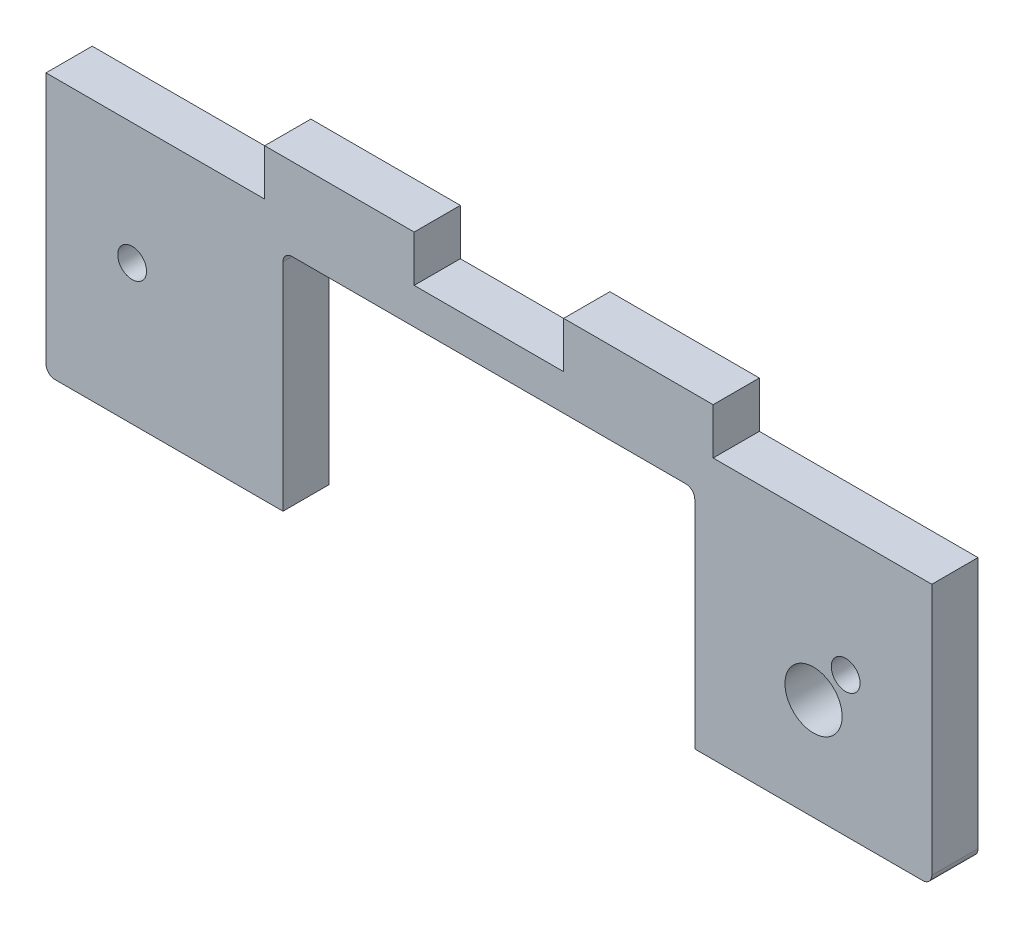
ISO-10303-21;
HEADER;
FILE_DESCRIPTION(('STEP AP214'),'2;1');
FILE_NAME('part.step','',(''),(''),'','','');
FILE_SCHEMA(('AUTOMOTIVE_DESIGN { 1 0 10303 214 1 1 1 1 }'));
ENDSEC;
DATA;
#1=APPLICATION_CONTEXT('core data for automotive mechanical design processes');
#2=APPLICATION_PROTOCOL_DEFINITION('international standard','automotive_design',2000,#1);
#3=PRODUCT_CONTEXT('',#1,'mechanical');
#4=PRODUCT('Part','Part','',(#3));
#5=PRODUCT_RELATED_PRODUCT_CATEGORY('part','',(#4));
#6=PRODUCT_DEFINITION_FORMATION('','',#4);
#7=PRODUCT_DEFINITION_CONTEXT('part definition',#1,'design');
#8=PRODUCT_DEFINITION('design','',#6,#7);
#9=PRODUCT_DEFINITION_SHAPE('','',#8);
#10=(LENGTH_UNIT() NAMED_UNIT(*) SI_UNIT(.MILLI.,.METRE.));
#11=(NAMED_UNIT(*) PLANE_ANGLE_UNIT() SI_UNIT($,.RADIAN.));
#12=(NAMED_UNIT(*) SI_UNIT($,.STERADIAN.) SOLID_ANGLE_UNIT());
#13=UNCERTAINTY_MEASURE_WITH_UNIT(LENGTH_MEASURE(1.E-05),#10,'distance_accuracy_value','');
#14=(GEOMETRIC_REPRESENTATION_CONTEXT(3) GLOBAL_UNCERTAINTY_ASSIGNED_CONTEXT((#13)) GLOBAL_UNIT_ASSIGNED_CONTEXT((#10,
#11,#12)) REPRESENTATION_CONTEXT('',''));
#15=CARTESIAN_POINT('',(0.,0.,0.));
#16=DIRECTION('',(0.,0.,1.));
#17=DIRECTION('',(1.,0.,0.));
#18=AXIS2_PLACEMENT_3D('',#15,#16,#17);
#19=CARTESIAN_POINT('',(-55.4887597438966,1.35674708835044,5.13));
#20=DIRECTION('',(0.,1.,0.));
#21=DIRECTION('',(-1.,0.,0.));
#22=AXIS2_PLACEMENT_3D('',#19,#20,#21);
#23=PLANE('',#22);
#24=DIRECTION('',(1.,0.,0.));
#25=VECTOR('',#24,1.);
#26=CARTESIAN_POINT('',(-55.4887597438966,1.35674708835044,5.13));
#27=LINE('',#26,#25);
#28=CARTESIAN_POINT('',(15.5512402561034,1.35674708835044,5.13));
#29=VERTEX_POINT('',#28);
#30=CARTESIAN_POINT('',(40.8712402561034,1.35674708835044,5.13));
#31=VERTEX_POINT('',#30);
#32=EDGE_CURVE('E449',#29,#31,#27,.T.);
#33=ORIENTED_EDGE('',*,*,#32,.F.);
#34=DIRECTION('',(0.,0.,1.));
#35=VECTOR('',#34,1.);
#36=CARTESIAN_POINT('',(15.5512402561034,1.35674708835044,-0.00104999999999984));
#37=LINE('',#36,#35);
#38=CARTESIAN_POINT('',(15.5512402561034,1.35674708835044,0.));
#39=VERTEX_POINT('',#38);
#40=EDGE_CURVE('E182',#39,#29,#37,.T.);
#41=ORIENTED_EDGE('',*,*,#40,.F.);
#42=DIRECTION('',(1.,0.,0.));
#43=VECTOR('',#42,1.);
#44=CARTESIAN_POINT('',(-55.4887597438966,1.35674708835044,0.));
#45=LINE('',#44,#43);
#46=CARTESIAN_POINT('',(40.8712402561034,1.35674708835044,0.));
#47=VERTEX_POINT('',#46);
#48=EDGE_CURVE('E200',#39,#47,#45,.T.);
#49=ORIENTED_EDGE('',*,*,#48,.T.);
#50=DIRECTION('',(0.,0.,-1.));
#51=VECTOR('',#50,1.);
#52=CARTESIAN_POINT('',(40.8712402561034,1.35674708835044,5.13));
#53=LINE('',#52,#51);
#54=EDGE_CURVE('E224',#31,#47,#53,.T.);
#55=ORIENTED_EDGE('',*,*,#54,.F.);
#56=EDGE_LOOP('',(#33,#41,#49,#55));
#57=FACE_BOUND('',#56,.T.);
#58=ADVANCED_FACE('F32',(#57),#23,.F.);
#59=CARTESIAN_POINT('',(-55.4887597438966,2.35674708835044,5.13));
#60=DIRECTION('',(0.,0.,-1.));
#61=DIRECTION('',(-1.,0.,0.));
#62=AXIS2_PLACEMENT_3D('',#59,#60,#61);
#63=PLANE('',#62);
#64=CARTESIAN_POINT('',(28.7382402561034,12.6521396028309,5.13));
#65=DIRECTION('',(0.,0.,1.));
#66=DIRECTION('',(1.,0.,0.));
#67=AXIS2_PLACEMENT_3D('',#64,#65,#66);
#68=CIRCLE('',#67,3.175);
#69=CARTESIAN_POINT('',(31.9132402561034,12.6521396028309,5.13));
#70=VERTEX_POINT('',#69);
#71=EDGE_CURVE('E368',#70,#70,#68,.T.);
#72=ORIENTED_EDGE('',*,*,#71,.F.);
#73=EDGE_LOOP('',(#72));
#74=FACE_BOUND('',#73,.T.);
#75=CARTESIAN_POINT('',(32.3062402561034,16.8567470883504,5.13));
#76=DIRECTION('',(0.,0.,1.));
#77=DIRECTION('',(1.,0.,0.));
#78=AXIS2_PLACEMENT_3D('',#75,#76,#77);
#79=CIRCLE('',#78,1.59999999999999);
#80=CARTESIAN_POINT('',(33.9062402561034,16.8567470883504,5.13));
#81=VERTEX_POINT('',#80);
#82=EDGE_CURVE('E333',#81,#81,#79,.T.);
#83=ORIENTED_EDGE('',*,*,#82,.F.);
#84=EDGE_LOOP('',(#83));
#85=FACE_BOUND('',#84,.T.);
#86=CARTESIAN_POINT('',(14.5512402561034,25.3567470883504,5.13));
#87=DIRECTION('',(0.,0.,1.));
#88=DIRECTION('',(1.,0.,0.));
#89=AXIS2_PLACEMENT_3D('',#86,#87,#88);
#90=CIRCLE('',#89,1.);
#91=CARTESIAN_POINT('',(15.5512402561034,25.3567470883504,5.13));
#92=VERTEX_POINT('',#91);
#93=CARTESIAN_POINT('',(14.5512402561034,26.3567470883504,5.13));
#94=VERTEX_POINT('',#93);
#95=EDGE_CURVE('E359',#92,#94,#90,.T.);
#96=ORIENTED_EDGE('',*,*,#95,.F.);
#97=DIRECTION('',(0.,1.,0.));
#98=VECTOR('',#97,1.);
#99=CARTESIAN_POINT('',(15.5512402561034,25.3567470883504,5.13));
#100=LINE('',#99,#98);
#101=EDGE_CURVE('E361',#29,#92,#100,.T.);
#102=ORIENTED_EDGE('',*,*,#101,.F.);
#103=ORIENTED_EDGE('',*,*,#32,.T.);
#104=CARTESIAN_POINT('',(40.8712402561034,2.35674708835044,5.13));
#105=DIRECTION('',(0.,0.,1.));
#106=DIRECTION('',(1.,0.,0.));
#107=AXIS2_PLACEMENT_3D('',#104,#105,#106);
#108=CIRCLE('',#107,1.);
#109=CARTESIAN_POINT('',(41.8712402561034,2.35674708835045,5.13));
#110=VERTEX_POINT('',#109);
#111=EDGE_CURVE('E452',#31,#110,#108,.T.);
#112=ORIENTED_EDGE('',*,*,#111,.T.);
#113=DIRECTION('',(0.,1.,0.));
#114=VECTOR('',#113,1.);
#115=CARTESIAN_POINT('',(41.8712402561034,30.3567470883504,5.13));
#116=LINE('',#115,#114);
#117=CARTESIAN_POINT('',(41.8712402561034,30.3567470883504,5.13));
#118=VERTEX_POINT('',#117);
#119=EDGE_CURVE('E251',#110,#118,#116,.T.);
#120=ORIENTED_EDGE('',*,*,#119,.T.);
#121=DIRECTION('',(-1.,0.,0.));
#122=VECTOR('',#121,1.);
#123=CARTESIAN_POINT('',(-56.4887597438966,30.3567470883504,5.13));
#124=LINE('',#123,#122);
#125=CARTESIAN_POINT('',(17.5912402561034,30.3567470883504,5.13));
#126=VERTEX_POINT('',#125);
#127=EDGE_CURVE('E236',#118,#126,#124,.T.);
#128=ORIENTED_EDGE('',*,*,#127,.T.);
#129=DIRECTION('',(0.,-1.,0.));
#130=VECTOR('',#129,1.);
#131=CARTESIAN_POINT('',(17.5912402561034,35.4867470883504,5.13));
#132=LINE('',#131,#130);
#133=CARTESIAN_POINT('',(17.5912402561034,35.4867470883504,5.13));
#134=VERTEX_POINT('',#133);
#135=EDGE_CURVE('E259',#134,#126,#132,.T.);
#136=ORIENTED_EDGE('',*,*,#135,.F.);
#137=DIRECTION('',(1.,0.,0.));
#138=VECTOR('',#137,1.);
#139=CARTESIAN_POINT('',(0.991240256103407,35.4867470883504,5.12999999999977));
#140=LINE('',#139,#138);
#141=CARTESIAN_POINT('',(0.991240256103407,35.4867470883504,5.12999999999977));
#142=VERTEX_POINT('',#141);
#143=EDGE_CURVE('E300',#142,#134,#140,.T.);
#144=ORIENTED_EDGE('',*,*,#143,.F.);
#145=DIRECTION('',(0.,-1.,0.));
#146=VECTOR('',#145,1.);
#147=CARTESIAN_POINT('',(0.991240256103407,35.4867470883504,5.12999999999977));
#148=LINE('',#147,#146);
#149=CARTESIAN_POINT('',(0.991240256103407,30.3567470883504,5.13));
#150=VERTEX_POINT('',#149);
#151=EDGE_CURVE('E256',#142,#150,#148,.T.);
#152=ORIENTED_EDGE('',*,*,#151,.T.);
#153=CARTESIAN_POINT('',(-15.6087597438966,30.3567470883504,5.13));
#154=VERTEX_POINT('',#153);
#155=EDGE_CURVE('E242',#150,#154,#124,.T.);
#156=ORIENTED_EDGE('',*,*,#155,.T.);
#157=DIRECTION('',(0.,-1.,0.));
#158=VECTOR('',#157,1.);
#159=CARTESIAN_POINT('',(-15.6087597438966,35.4867470883504,5.13000000000023));
#160=LINE('',#159,#158);
#161=CARTESIAN_POINT('',(-15.6087597438966,35.4867470883504,5.13000000000023));
#162=VERTEX_POINT('',#161);
#163=EDGE_CURVE('E306',#162,#154,#160,.T.);
#164=ORIENTED_EDGE('',*,*,#163,.F.);
#165=DIRECTION('',(1.,0.,0.));
#166=VECTOR('',#165,1.);
#167=CARTESIAN_POINT('',(-32.2087597438966,35.4867470883504,5.13));
#168=LINE('',#167,#166);
#169=CARTESIAN_POINT('',(-32.2087597438966,35.4867470883504,5.13));
#170=VERTEX_POINT('',#169);
#171=EDGE_CURVE('E327',#170,#162,#168,.T.);
#172=ORIENTED_EDGE('',*,*,#171,.F.);
#173=DIRECTION('',(0.,-1.,0.));
#174=VECTOR('',#173,1.);
#175=CARTESIAN_POINT('',(-32.2087597438966,35.4867470883504,5.13));
#176=LINE('',#175,#174);
#177=CARTESIAN_POINT('',(-32.2087597438966,30.3567470883504,5.13));
#178=VERTEX_POINT('',#177);
#179=EDGE_CURVE('E274',#170,#178,#176,.T.);
#180=ORIENTED_EDGE('',*,*,#179,.T.);
#181=CARTESIAN_POINT('',(-56.4887597438966,30.3567470883504,5.13));
#182=VERTEX_POINT('',#181);
#183=EDGE_CURVE('E36',#178,#182,#124,.T.);
#184=ORIENTED_EDGE('',*,*,#183,.T.);
#185=DIRECTION('',(0.,-1.,0.));
#186=VECTOR('',#185,1.);
#187=CARTESIAN_POINT('',(-56.4887597438966,30.3567470883504,5.13));
#188=LINE('',#187,#186);
#189=CARTESIAN_POINT('',(-56.4887597438966,2.35674708835045,5.13));
#190=VERTEX_POINT('',#189);
#191=EDGE_CURVE('E221',#182,#190,#188,.T.);
#192=ORIENTED_EDGE('',*,*,#191,.T.);
#193=CARTESIAN_POINT('',(-55.4887597438966,2.35674708835044,5.13));
#194=DIRECTION('',(0.,0.,1.));
#195=DIRECTION('',(-1.,0.,0.));
#196=AXIS2_PLACEMENT_3D('',#193,#194,#195);
#197=CIRCLE('',#196,1.);
#198=CARTESIAN_POINT('',(-55.4887597438966,1.35674708835044,5.13));
#199=VERTEX_POINT('',#198);
#200=EDGE_CURVE('E448',#190,#199,#197,.T.);
#201=ORIENTED_EDGE('',*,*,#200,.T.);
#202=CARTESIAN_POINT('',(-30.1687597438966,1.35674708835044,5.13));
#203=VERTEX_POINT('',#202);
#204=EDGE_CURVE('E450',#199,#203,#27,.T.);
#205=ORIENTED_EDGE('',*,*,#204,.T.);
#206=DIRECTION('',(0.,-1.,0.));
#207=VECTOR('',#206,1.);
#208=CARTESIAN_POINT('',(-30.1687597438966,25.3567470883504,5.13));
#209=LINE('',#208,#207);
#210=CARTESIAN_POINT('',(-30.1687597438966,25.3567470883504,5.13));
#211=VERTEX_POINT('',#210);
#212=EDGE_CURVE('E177',#211,#203,#209,.T.);
#213=ORIENTED_EDGE('',*,*,#212,.F.);
#214=CARTESIAN_POINT('',(-29.1687597438966,25.3567470883504,5.13));
#215=DIRECTION('',(0.,0.,1.));
#216=DIRECTION('',(-1.,0.,0.));
#217=AXIS2_PLACEMENT_3D('',#214,#215,#216);
#218=CIRCLE('',#217,1.);
#219=CARTESIAN_POINT('',(-29.1687597438966,26.3567470883504,5.13));
#220=VERTEX_POINT('',#219);
#221=EDGE_CURVE('E353',#220,#211,#218,.T.);
#222=ORIENTED_EDGE('',*,*,#221,.F.);
#223=DIRECTION('',(-1.,0.,0.));
#224=VECTOR('',#223,1.);
#225=CARTESIAN_POINT('',(-29.1687597438966,26.3567470883504,5.13));
#226=LINE('',#225,#224);
#227=EDGE_CURVE('E356',#94,#220,#226,.T.);
#228=ORIENTED_EDGE('',*,*,#227,.F.);
#229=EDGE_LOOP('',(#96,#102,#103,#112,#120,#128,#136,#144,#152,#156,#164,#172,#180,#184,#192,
#201,#205,#213,#222,#228));
#230=FACE_BOUND('',#229,.T.);
#231=CARTESIAN_POINT('',(-46.9237597438966,16.8567470883504,5.13));
#232=DIRECTION('',(0.,0.,1.));
#233=DIRECTION('',(1.,0.,0.));
#234=AXIS2_PLACEMENT_3D('',#231,#232,#233);
#235=CIRCLE('',#234,1.59999999999998);
#236=CARTESIAN_POINT('',(-45.3237597438966,16.8567470883504,5.13));
#237=VERTEX_POINT('',#236);
#238=EDGE_CURVE('E339',#237,#237,#235,.T.);
#239=ORIENTED_EDGE('',*,*,#238,.F.);
#240=EDGE_LOOP('',(#239));
#241=FACE_BOUND('',#240,.T.);
#242=ADVANCED_FACE('F377',(#74,#85,#230,#241),#63,.F.);
#243=CARTESIAN_POINT('',(-56.4887597438966,30.3567470883504,5.13));
#244=DIRECTION('',(0.,-1.,0.));
#245=DIRECTION('',(0.,0.,-1.));
#246=AXIS2_PLACEMENT_3D('',#243,#244,#245);
#247=PLANE('',#246);
#248=DIRECTION('',(0.,0.,1.));
#249=VECTOR('',#248,1.);
#250=CARTESIAN_POINT('',(-32.2087597438966,30.3567470883504,5.13));
#251=LINE('',#250,#249);
#252=CARTESIAN_POINT('',(-32.2087597438966,30.3567470883504,2.31834495177663E-13));
#253=VERTEX_POINT('',#252);
#254=EDGE_CURVE('E320',#253,#178,#251,.T.);
#255=ORIENTED_EDGE('',*,*,#254,.F.);
#256=DIRECTION('',(-1.,0.,0.));
#257=VECTOR('',#256,1.);
#258=CARTESIAN_POINT('',(-56.4887597438966,30.3567470883504,0.));
#259=LINE('',#258,#257);
#260=CARTESIAN_POINT('',(-56.4887597438966,30.3567470883504,0.));
#261=VERTEX_POINT('',#260);
#262=EDGE_CURVE('E209',#253,#261,#259,.T.);
#263=ORIENTED_EDGE('',*,*,#262,.T.);
#264=DIRECTION('',(0.,0.,-1.));
#265=VECTOR('',#264,1.);
#266=CARTESIAN_POINT('',(-56.4887597438966,30.3567470883504,5.13));
#267=LINE('',#266,#265);
#268=EDGE_CURVE('E212',#182,#261,#267,.T.);
#269=ORIENTED_EDGE('',*,*,#268,.F.);
#270=ORIENTED_EDGE('',*,*,#183,.F.);
#271=EDGE_LOOP('',(#255,#263,#269,#270));
#272=FACE_BOUND('',#271,.T.);
#273=ADVANCED_FACE('F380',(#272),#247,.F.);
#274=DIRECTION('',(0.,0.,-1.));
#275=VECTOR('',#274,1.);
#276=CARTESIAN_POINT('',(-15.6087597438966,30.3567470883504,5.13000000000023));
#277=LINE('',#276,#275);
#278=CARTESIAN_POINT('',(-15.6087597438966,30.3567470883504,0.));
#279=VERTEX_POINT('',#278);
#280=EDGE_CURVE('E316',#154,#279,#277,.T.);
#281=ORIENTED_EDGE('',*,*,#280,.F.);
#282=ORIENTED_EDGE('',*,*,#155,.F.);
#283=DIRECTION('',(0.,0.,1.));
#284=VECTOR('',#283,1.);
#285=CARTESIAN_POINT('',(0.991240256103407,30.3567470883504,5.12999999999977));
#286=LINE('',#285,#284);
#287=CARTESIAN_POINT('',(0.991240256103407,30.3567470883504,0.));
#288=VERTEX_POINT('',#287);
#289=EDGE_CURVE('E270',#288,#150,#286,.T.);
#290=ORIENTED_EDGE('',*,*,#289,.F.);
#291=EDGE_CURVE('E217',#288,#279,#259,.T.);
#292=ORIENTED_EDGE('',*,*,#291,.T.);
#293=EDGE_LOOP('',(#281,#282,#290,#292));
#294=FACE_BOUND('',#293,.T.);
#295=ADVANCED_FACE('F446',(#294),#247,.F.);
#296=DIRECTION('',(0.,0.,-1.));
#297=VECTOR('',#296,1.);
#298=CARTESIAN_POINT('',(17.5912402561034,30.3567470883504,5.13));
#299=LINE('',#298,#297);
#300=CARTESIAN_POINT('',(17.5912402561034,30.3567470883504,0.));
#301=VERTEX_POINT('',#300);
#302=EDGE_CURVE('E273',#126,#301,#299,.T.);
#303=ORIENTED_EDGE('',*,*,#302,.F.);
#304=ORIENTED_EDGE('',*,*,#127,.F.);
#305=DIRECTION('',(0.,0.,-1.));
#306=VECTOR('',#305,1.);
#307=CARTESIAN_POINT('',(41.8712402561034,30.3567470883504,5.13));
#308=LINE('',#307,#306);
#309=CARTESIAN_POINT('',(41.8712402561034,30.3567470883504,0.));
#310=VERTEX_POINT('',#309);
#311=EDGE_CURVE('E229',#118,#310,#308,.T.);
#312=ORIENTED_EDGE('',*,*,#311,.T.);
#313=EDGE_CURVE('E220',#310,#301,#259,.T.);
#314=ORIENTED_EDGE('',*,*,#313,.T.);
#315=EDGE_LOOP('',(#303,#304,#312,#314));
#316=FACE_BOUND('',#315,.T.);
#317=ADVANCED_FACE('F433',(#316),#247,.F.);
#318=CARTESIAN_POINT('',(-56.4887597438966,30.3567470883504,5.13));
#319=DIRECTION('',(1.,0.,0.));
#320=DIRECTION('',(0.,0.,-1.));
#321=AXIS2_PLACEMENT_3D('',#318,#319,#320);
#322=PLANE('',#321);
#323=DIRECTION('',(0.,-1.,0.));
#324=VECTOR('',#323,1.);
#325=CARTESIAN_POINT('',(-56.4887597438966,30.3567470883504,0.));
#326=LINE('',#325,#324);
#327=CARTESIAN_POINT('',(-56.4887597438966,2.35674708835045,0.));
#328=VERTEX_POINT('',#327);
#329=EDGE_CURVE('E253',#261,#328,#326,.T.);
#330=ORIENTED_EDGE('',*,*,#329,.T.);
#331=DIRECTION('',(0.,0.,-1.));
#332=VECTOR('',#331,1.);
#333=CARTESIAN_POINT('',(-56.4887597438966,2.35674708835045,5.13));
#334=LINE('',#333,#332);
#335=EDGE_CURVE('E11',#190,#328,#334,.T.);
#336=ORIENTED_EDGE('',*,*,#335,.F.);
#337=ORIENTED_EDGE('',*,*,#191,.F.);
#338=ORIENTED_EDGE('',*,*,#268,.T.);
#339=EDGE_LOOP('',(#330,#336,#337,#338));
#340=FACE_BOUND('',#339,.T.);
#341=ADVANCED_FACE('F34',(#340),#322,.F.);
#342=CARTESIAN_POINT('',(-55.4887597438966,2.35674708835044,5.13));
#343=DIRECTION('',(0.,0.,-1.));
#344=DIRECTION('',(-1.,0.,0.));
#345=AXIS2_PLACEMENT_3D('',#342,#343,#344);
#346=CYLINDRICAL_SURFACE('',#345,1.);
#347=CARTESIAN_POINT('',(-55.4887597438966,2.35674708835044,0.));
#348=DIRECTION('',(0.,0.,1.));
#349=DIRECTION('',(-1.,0.,0.));
#350=AXIS2_PLACEMENT_3D('',#347,#348,#349);
#351=CIRCLE('',#350,1.);
#352=CARTESIAN_POINT('',(-55.4887597438966,1.35674708835044,0.));
#353=VERTEX_POINT('',#352);
#354=EDGE_CURVE('E204',#328,#353,#351,.T.);
#355=ORIENTED_EDGE('',*,*,#354,.T.);
#356=DIRECTION('',(0.,0.,-1.));
#357=VECTOR('',#356,1.);
#358=CARTESIAN_POINT('',(-55.4887597438966,1.35674708835044,5.13));
#359=LINE('',#358,#357);
#360=EDGE_CURVE('E42',#199,#353,#359,.T.);
#361=ORIENTED_EDGE('',*,*,#360,.F.);
#362=ORIENTED_EDGE('',*,*,#200,.F.);
#363=ORIENTED_EDGE('',*,*,#335,.T.);
#364=EDGE_LOOP('',(#355,#361,#362,#363));
#365=FACE_BOUND('',#364,.T.);
#366=ADVANCED_FACE('F423',(#365),#346,.T.);
#367=CARTESIAN_POINT('',(-30.1687597438966,1.35674708835044,0.));
#368=VERTEX_POINT('',#367);
#369=EDGE_CURVE('E191',#353,#368,#45,.T.);
#370=ORIENTED_EDGE('',*,*,#369,.T.);
#371=DIRECTION('',(0.,0.,1.));
#372=VECTOR('',#371,1.);
#373=CARTESIAN_POINT('',(-30.1687597438966,1.35674708835044,-0.00104999999999984));
#374=LINE('',#373,#372);
#375=EDGE_CURVE('E171',#368,#203,#374,.T.);
#376=ORIENTED_EDGE('',*,*,#375,.T.);
#377=ORIENTED_EDGE('',*,*,#204,.F.);
#378=ORIENTED_EDGE('',*,*,#360,.T.);
#379=EDGE_LOOP('',(#370,#376,#377,#378));
#380=FACE_BOUND('',#379,.T.);
#381=ADVANCED_FACE('F197',(#380),#23,.F.);
#382=CARTESIAN_POINT('',(40.8712402561034,2.35674708835044,5.13));
#383=DIRECTION('',(0.,0.,-1.));
#384=DIRECTION('',(-1.,0.,0.));
#385=AXIS2_PLACEMENT_3D('',#382,#383,#384);
#386=CYLINDRICAL_SURFACE('',#385,1.);
#387=CARTESIAN_POINT('',(40.8712402561034,2.35674708835044,0.));
#388=DIRECTION('',(0.,0.,1.));
#389=DIRECTION('',(1.,0.,0.));
#390=AXIS2_PLACEMENT_3D('',#387,#388,#389);
#391=CIRCLE('',#390,1.);
#392=CARTESIAN_POINT('',(41.8712402561034,2.35674708835045,0.));
#393=VERTEX_POINT('',#392);
#394=EDGE_CURVE('E199',#47,#393,#391,.T.);
#395=ORIENTED_EDGE('',*,*,#394,.T.);
#396=DIRECTION('',(0.,0.,-1.));
#397=VECTOR('',#396,1.);
#398=CARTESIAN_POINT('',(41.8712402561034,2.35674708835045,5.13));
#399=LINE('',#398,#397);
#400=EDGE_CURVE('E227',#110,#393,#399,.T.);
#401=ORIENTED_EDGE('',*,*,#400,.F.);
#402=ORIENTED_EDGE('',*,*,#111,.F.);
#403=ORIENTED_EDGE('',*,*,#54,.T.);
#404=EDGE_LOOP('',(#395,#401,#402,#403));
#405=FACE_BOUND('',#404,.T.);
#406=ADVANCED_FACE('F422',(#405),#386,.T.);
#407=CARTESIAN_POINT('',(41.8712402561034,30.3567470883504,5.13));
#408=DIRECTION('',(-1.,0.,0.));
#409=DIRECTION('',(0.,-1.,0.));
#410=AXIS2_PLACEMENT_3D('',#407,#408,#409);
#411=PLANE('',#410);
#412=DIRECTION('',(0.,1.,0.));
#413=VECTOR('',#412,1.);
#414=CARTESIAN_POINT('',(41.8712402561034,30.3567470883504,0.));
#415=LINE('',#414,#413);
#416=EDGE_CURVE('E202',#393,#310,#415,.T.);
#417=ORIENTED_EDGE('',*,*,#416,.T.);
#418=ORIENTED_EDGE('',*,*,#311,.F.);
#419=ORIENTED_EDGE('',*,*,#119,.F.);
#420=ORIENTED_EDGE('',*,*,#400,.T.);
#421=EDGE_LOOP('',(#417,#418,#419,#420));
#422=FACE_BOUND('',#421,.T.);
#423=ADVANCED_FACE('F399',(#422),#411,.F.);
#424=CARTESIAN_POINT('',(-55.4887597438966,2.35674708835044,0.));
#425=DIRECTION('',(0.,0.,-1.));
#426=DIRECTION('',(-1.,0.,0.));
#427=AXIS2_PLACEMENT_3D('',#424,#425,#426);
#428=PLANE('',#427);
#429=CARTESIAN_POINT('',(28.7382402561034,12.6521396028309,0.));
#430=DIRECTION('',(0.,0.,-1.));
#431=DIRECTION('',(-1.,0.,0.));
#432=AXIS2_PLACEMENT_3D('',#429,#430,#431);
#433=CIRCLE('',#432,3.175);
#434=CARTESIAN_POINT('',(25.5632402561034,12.6521396028309,0.));
#435=VERTEX_POINT('',#434);
#436=EDGE_CURVE('E369',#435,#435,#433,.F.);
#437=ORIENTED_EDGE('',*,*,#436,.T.);
#438=EDGE_LOOP('',(#437));
#439=FACE_BOUND('',#438,.T.);
#440=DIRECTION('',(0.,1.,0.));
#441=VECTOR('',#440,1.);
#442=CARTESIAN_POINT('',(15.5512402561034,25.3567470883504,0.));
#443=LINE('',#442,#441);
#444=CARTESIAN_POINT('',(15.5512402561034,25.3567470883504,0.));
#445=VERTEX_POINT('',#444);
#446=EDGE_CURVE('E194',#39,#445,#443,.T.);
#447=ORIENTED_EDGE('',*,*,#446,.T.);
#448=CARTESIAN_POINT('',(14.5512402561034,25.3567470883504,0.));
#449=DIRECTION('',(0.,0.,-1.));
#450=DIRECTION('',(-1.,0.,0.));
#451=AXIS2_PLACEMENT_3D('',#448,#449,#450);
#452=CIRCLE('',#451,1.);
#453=CARTESIAN_POINT('',(14.5512402561034,26.3567470883504,0.));
#454=VERTEX_POINT('',#453);
#455=EDGE_CURVE('E342',#445,#454,#452,.F.);
#456=ORIENTED_EDGE('',*,*,#455,.T.);
#457=DIRECTION('',(-1.,0.,0.));
#458=VECTOR('',#457,1.);
#459=CARTESIAN_POINT('',(-29.1687597438966,26.3567470883504,0.));
#460=LINE('',#459,#458);
#461=CARTESIAN_POINT('',(-29.1687597438966,26.3567470883504,0.));
#462=VERTEX_POINT('',#461);
#463=EDGE_CURVE('E366',#454,#462,#460,.T.);
#464=ORIENTED_EDGE('',*,*,#463,.T.);
#465=CARTESIAN_POINT('',(-29.1687597438966,25.3567470883504,0.));
#466=DIRECTION('',(0.,0.,-1.));
#467=DIRECTION('',(-1.,0.,0.));
#468=AXIS2_PLACEMENT_3D('',#465,#466,#467);
#469=CIRCLE('',#468,1.);
#470=CARTESIAN_POINT('',(-30.1687597438966,25.3567470883504,0.));
#471=VERTEX_POINT('',#470);
#472=EDGE_CURVE('E193',#462,#471,#469,.F.);
#473=ORIENTED_EDGE('',*,*,#472,.T.);
#474=DIRECTION('',(0.,-1.,0.));
#475=VECTOR('',#474,1.);
#476=CARTESIAN_POINT('',(-30.1687597438966,25.3567470883504,0.));
#477=LINE('',#476,#475);
#478=EDGE_CURVE('E174',#471,#368,#477,.T.);
#479=ORIENTED_EDGE('',*,*,#478,.T.);
#480=ORIENTED_EDGE('',*,*,#369,.F.);
#481=ORIENTED_EDGE('',*,*,#354,.F.);
#482=ORIENTED_EDGE('',*,*,#329,.F.);
#483=ORIENTED_EDGE('',*,*,#262,.F.);
#484=DIRECTION('',(0.,-1.,0.));
#485=VECTOR('',#484,1.);
#486=CARTESIAN_POINT('',(-32.2087597438966,35.4867470883504,2.31834495177663E-13));
#487=LINE('',#486,#485);
#488=CARTESIAN_POINT('',(-32.2087597438966,35.4867470883504,2.31834495177663E-13));
#489=VERTEX_POINT('',#488);
#490=EDGE_CURVE('E312',#489,#253,#487,.T.);
#491=ORIENTED_EDGE('',*,*,#490,.F.);
#492=DIRECTION('',(-1.,0.,0.));
#493=VECTOR('',#492,1.);
#494=CARTESIAN_POINT('',(-32.2087597438966,35.4867470883504,2.31834495177663E-13));
#495=LINE('',#494,#493);
#496=CARTESIAN_POINT('',(-15.6087597438966,35.4867470883504,2.31834495177663E-13));
#497=VERTEX_POINT('',#496);
#498=EDGE_CURVE('E315',#497,#489,#495,.T.);
#499=ORIENTED_EDGE('',*,*,#498,.F.);
#500=DIRECTION('',(0.,-1.,0.));
#501=VECTOR('',#500,1.);
#502=CARTESIAN_POINT('',(-15.6087597438966,35.4867470883504,2.31834495177663E-13));
#503=LINE('',#502,#501);
#504=EDGE_CURVE('E309',#497,#279,#503,.T.);
#505=ORIENTED_EDGE('',*,*,#504,.T.);
#506=ORIENTED_EDGE('',*,*,#291,.F.);
#507=DIRECTION('',(0.,-1.,0.));
#508=VECTOR('',#507,1.);
#509=CARTESIAN_POINT('',(0.991240256103407,35.4867470883504,0.));
#510=LINE('',#509,#508);
#511=CARTESIAN_POINT('',(0.991240256103407,35.4867470883504,0.));
#512=VERTEX_POINT('',#511);
#513=EDGE_CURVE('E275',#512,#288,#510,.T.);
#514=ORIENTED_EDGE('',*,*,#513,.F.);
#515=DIRECTION('',(-1.,0.,0.));
#516=VECTOR('',#515,1.);
#517=CARTESIAN_POINT('',(0.991240256103407,35.4867470883504,0.));
#518=LINE('',#517,#516);
#519=CARTESIAN_POINT('',(17.5912402561034,35.4867470883504,0.));
#520=VERTEX_POINT('',#519);
#521=EDGE_CURVE('E280',#520,#512,#518,.T.);
#522=ORIENTED_EDGE('',*,*,#521,.F.);
#523=DIRECTION('',(0.,-1.,0.));
#524=VECTOR('',#523,1.);
#525=CARTESIAN_POINT('',(17.5912402561034,35.4867470883504,0.));
#526=LINE('',#525,#524);
#527=EDGE_CURVE('E263',#520,#301,#526,.T.);
#528=ORIENTED_EDGE('',*,*,#527,.T.);
#529=ORIENTED_EDGE('',*,*,#313,.F.);
#530=ORIENTED_EDGE('',*,*,#416,.F.);
#531=ORIENTED_EDGE('',*,*,#394,.F.);
#532=ORIENTED_EDGE('',*,*,#48,.F.);
#533=EDGE_LOOP('',(#447,#456,#464,#473,#479,#480,#481,#482,#483,#491,#499,#505,#506,#514,#522,
#528,#529,#530,#531,#532));
#534=FACE_BOUND('',#533,.T.);
#535=CARTESIAN_POINT('',(-46.9237597438966,16.8567470883504,0.));
#536=DIRECTION('',(0.,0.,-1.));
#537=DIRECTION('',(-1.,0.,0.));
#538=AXIS2_PLACEMENT_3D('',#535,#536,#537);
#539=CIRCLE('',#538,1.59999999999999);
#540=CARTESIAN_POINT('',(-48.5237597438966,16.8567470883504,0.));
#541=VERTEX_POINT('',#540);
#542=EDGE_CURVE('E336',#541,#541,#539,.T.);
#543=ORIENTED_EDGE('',*,*,#542,.F.);
#544=EDGE_LOOP('',(#543));
#545=FACE_BOUND('',#544,.T.);
#546=CARTESIAN_POINT('',(32.3062402561034,16.8567470883504,0.));
#547=DIRECTION('',(0.,0.,-1.));
#548=DIRECTION('',(-1.,0.,0.));
#549=AXIS2_PLACEMENT_3D('',#546,#547,#548);
#550=CIRCLE('',#549,1.59999999999999);
#551=CARTESIAN_POINT('',(30.7062402561034,16.8567470883504,0.));
#552=VERTEX_POINT('',#551);
#553=EDGE_CURVE('E323',#552,#552,#550,.T.);
#554=ORIENTED_EDGE('',*,*,#553,.F.);
#555=EDGE_LOOP('',(#554));
#556=FACE_BOUND('',#555,.T.);
#557=ADVANCED_FACE('F189',(#439,#534,#545,#556),#428,.T.);
#558=CARTESIAN_POINT('',(0.991240256103407,35.4867470883504,5.12999999999977));
#559=DIRECTION('',(1.,0.,0.));
#560=DIRECTION('',(0.,0.,-1.));
#561=AXIS2_PLACEMENT_3D('',#558,#559,#560);
#562=PLANE('',#561);
#563=ORIENTED_EDGE('',*,*,#289,.T.);
#564=ORIENTED_EDGE('',*,*,#151,.F.);
#565=DIRECTION('',(0.,0.,1.));
#566=VECTOR('',#565,1.);
#567=CARTESIAN_POINT('',(0.991240256103407,35.4867470883504,5.12999999999977));
#568=LINE('',#567,#566);
#569=EDGE_CURVE('E287',#512,#142,#568,.T.);
#570=ORIENTED_EDGE('',*,*,#569,.F.);
#571=ORIENTED_EDGE('',*,*,#513,.T.);
#572=EDGE_LOOP('',(#563,#564,#570,#571));
#573=FACE_BOUND('',#572,.T.);
#574=ADVANCED_FACE('F398',(#573),#562,.F.);
#575=CARTESIAN_POINT('',(17.5912402561034,35.4867470883504,5.13));
#576=DIRECTION('',(-1.,0.,0.));
#577=DIRECTION('',(0.,0.,1.));
#578=AXIS2_PLACEMENT_3D('',#575,#576,#577);
#579=PLANE('',#578);
#580=ORIENTED_EDGE('',*,*,#302,.T.);
#581=ORIENTED_EDGE('',*,*,#527,.F.);
#582=DIRECTION('',(0.,0.,-1.));
#583=VECTOR('',#582,1.);
#584=CARTESIAN_POINT('',(17.5912402561034,35.4867470883504,5.13));
#585=LINE('',#584,#583);
#586=EDGE_CURVE('E297',#134,#520,#585,.T.);
#587=ORIENTED_EDGE('',*,*,#586,.F.);
#588=ORIENTED_EDGE('',*,*,#135,.T.);
#589=EDGE_LOOP('',(#580,#581,#587,#588));
#590=FACE_BOUND('',#589,.T.);
#591=ADVANCED_FACE('F459',(#590),#579,.F.);
#592=CARTESIAN_POINT('',(0.991240256103407,35.4867470883504,0.));
#593=DIRECTION('',(0.,-1.,0.));
#594=DIRECTION('',(0.,0.,-1.));
#595=AXIS2_PLACEMENT_3D('',#592,#593,#594);
#596=PLANE('',#595);
#597=ORIENTED_EDGE('',*,*,#569,.T.);
#598=ORIENTED_EDGE('',*,*,#143,.T.);
#599=ORIENTED_EDGE('',*,*,#586,.T.);
#600=ORIENTED_EDGE('',*,*,#521,.T.);
#601=EDGE_LOOP('',(#597,#598,#599,#600));
#602=FACE_BOUND('',#601,.T.);
#603=ADVANCED_FACE('F460',(#602),#596,.F.);
#604=CARTESIAN_POINT('',(-32.2087597438966,35.4867470883504,5.13));
#605=DIRECTION('',(1.,0.,0.));
#606=DIRECTION('',(0.,0.,-1.));
#607=AXIS2_PLACEMENT_3D('',#604,#605,#606);
#608=PLANE('',#607);
#609=ORIENTED_EDGE('',*,*,#254,.T.);
#610=ORIENTED_EDGE('',*,*,#179,.F.);
#611=DIRECTION('',(0.,0.,1.));
#612=VECTOR('',#611,1.);
#613=CARTESIAN_POINT('',(-32.2087597438966,35.4867470883504,5.13));
#614=LINE('',#613,#612);
#615=EDGE_CURVE('E319',#489,#170,#614,.T.);
#616=ORIENTED_EDGE('',*,*,#615,.F.);
#617=ORIENTED_EDGE('',*,*,#490,.T.);
#618=EDGE_LOOP('',(#609,#610,#616,#617));
#619=FACE_BOUND('',#618,.T.);
#620=ADVANCED_FACE('F439',(#619),#608,.F.);
#621=CARTESIAN_POINT('',(-15.6087597438966,35.4867470883504,5.13000000000023));
#622=DIRECTION('',(-1.,0.,0.));
#623=DIRECTION('',(0.,0.,1.));
#624=AXIS2_PLACEMENT_3D('',#621,#622,#623);
#625=PLANE('',#624);
#626=ORIENTED_EDGE('',*,*,#280,.T.);
#627=ORIENTED_EDGE('',*,*,#504,.F.);
#628=DIRECTION('',(0.,0.,-1.));
#629=VECTOR('',#628,1.);
#630=CARTESIAN_POINT('',(-15.6087597438966,35.4867470883504,5.13000000000023));
#631=LINE('',#630,#629);
#632=EDGE_CURVE('E325',#162,#497,#631,.T.);
#633=ORIENTED_EDGE('',*,*,#632,.F.);
#634=ORIENTED_EDGE('',*,*,#163,.T.);
#635=EDGE_LOOP('',(#626,#627,#633,#634));
#636=FACE_BOUND('',#635,.T.);
#637=ADVANCED_FACE('F411',(#636),#625,.F.);
#638=CARTESIAN_POINT('',(-32.2087597438966,35.4867470883504,2.31834495177663E-13));
#639=DIRECTION('',(0.,-1.,0.));
#640=DIRECTION('',(0.,0.,-1.));
#641=AXIS2_PLACEMENT_3D('',#638,#639,#640);
#642=PLANE('',#641);
#643=ORIENTED_EDGE('',*,*,#615,.T.);
#644=ORIENTED_EDGE('',*,*,#171,.T.);
#645=ORIENTED_EDGE('',*,*,#632,.T.);
#646=ORIENTED_EDGE('',*,*,#498,.T.);
#647=EDGE_LOOP('',(#643,#644,#645,#646));
#648=FACE_BOUND('',#647,.T.);
#649=ADVANCED_FACE('F405',(#648),#642,.F.);
#650=CARTESIAN_POINT('',(32.3062402561034,16.8567470883504,5.13));
#651=DIRECTION('',(0.,0.,1.));
#652=DIRECTION('',(1.,0.,0.));
#653=AXIS2_PLACEMENT_3D('',#650,#651,#652);
#654=CYLINDRICAL_SURFACE('',#653,1.59999999999999);
#655=ORIENTED_EDGE('',*,*,#82,.T.);
#656=EDGE_LOOP('',(#655));
#657=FACE_BOUND('',#656,.T.);
#658=ORIENTED_EDGE('',*,*,#553,.T.);
#659=EDGE_LOOP('',(#658));
#660=FACE_BOUND('',#659,.T.);
#661=ADVANCED_FACE('F393',(#657,#660),#654,.F.);
#662=CARTESIAN_POINT('',(-46.9237597438966,16.8567470883504,5.13));
#663=DIRECTION('',(0.,0.,1.));
#664=DIRECTION('',(1.,0.,0.));
#665=AXIS2_PLACEMENT_3D('',#662,#663,#664);
#666=CYLINDRICAL_SURFACE('',#665,1.59999999999999);
#667=ORIENTED_EDGE('',*,*,#238,.T.);
#668=EDGE_LOOP('',(#667));
#669=FACE_BOUND('',#668,.T.);
#670=ORIENTED_EDGE('',*,*,#542,.T.);
#671=EDGE_LOOP('',(#670));
#672=FACE_BOUND('',#671,.T.);
#673=ADVANCED_FACE('F389',(#669,#672),#666,.F.);
#674=CARTESIAN_POINT('',(15.5512402561034,25.3567470883504,-0.00104999999999984));
#675=DIRECTION('',(1.,0.,0.));
#676=DIRECTION('',(0.,1.,0.));
#677=AXIS2_PLACEMENT_3D('',#674,#675,#676);
#678=PLANE('',#677);
#679=ORIENTED_EDGE('',*,*,#40,.T.);
#680=ORIENTED_EDGE('',*,*,#101,.T.);
#681=DIRECTION('',(0.,0.,1.));
#682=VECTOR('',#681,1.);
#683=CARTESIAN_POINT('',(15.5512402561034,25.3567470883504,-0.00104999999999984));
#684=LINE('',#683,#682);
#685=EDGE_CURVE('E345',#445,#92,#684,.T.);
#686=ORIENTED_EDGE('',*,*,#685,.F.);
#687=ORIENTED_EDGE('',*,*,#446,.F.);
#688=EDGE_LOOP('',(#679,#680,#686,#687));
#689=FACE_BOUND('',#688,.T.);
#690=ADVANCED_FACE('F392',(#689),#678,.F.);
#691=CARTESIAN_POINT('',(-30.1687597438966,25.3567470883504,-0.00104999999999984));
#692=DIRECTION('',(-1.,0.,0.));
#693=DIRECTION('',(0.,-1.,0.));
#694=AXIS2_PLACEMENT_3D('',#691,#692,#693);
#695=PLANE('',#694);
#696=DIRECTION('',(0.,0.,1.));
#697=VECTOR('',#696,1.);
#698=CARTESIAN_POINT('',(-30.1687597438966,25.3567470883504,-0.00104999999999984));
#699=LINE('',#698,#697);
#700=EDGE_CURVE('E183',#471,#211,#699,.T.);
#701=ORIENTED_EDGE('',*,*,#700,.T.);
#702=ORIENTED_EDGE('',*,*,#212,.T.);
#703=ORIENTED_EDGE('',*,*,#375,.F.);
#704=ORIENTED_EDGE('',*,*,#478,.F.);
#705=EDGE_LOOP('',(#701,#702,#703,#704));
#706=FACE_BOUND('',#705,.T.);
#707=ADVANCED_FACE('F173',(#706),#695,.F.);
#708=CARTESIAN_POINT('',(-29.1687597438966,25.3567470883504,-0.00104999999999984));
#709=DIRECTION('',(0.,0.,1.));
#710=DIRECTION('',(1.,0.,0.));
#711=AXIS2_PLACEMENT_3D('',#708,#709,#710);
#712=CYLINDRICAL_SURFACE('',#711,1.);
#713=DIRECTION('',(0.,0.,1.));
#714=VECTOR('',#713,1.);
#715=CARTESIAN_POINT('',(-29.1687597438966,26.3567470883504,-0.00104999999999984));
#716=LINE('',#715,#714);
#717=EDGE_CURVE('E348',#462,#220,#716,.T.);
#718=ORIENTED_EDGE('',*,*,#717,.T.);
#719=ORIENTED_EDGE('',*,*,#221,.T.);
#720=ORIENTED_EDGE('',*,*,#700,.F.);
#721=ORIENTED_EDGE('',*,*,#472,.F.);
#722=EDGE_LOOP('',(#718,#719,#720,#721));
#723=FACE_BOUND('',#722,.T.);
#724=ADVANCED_FACE('F511',(#723),#712,.F.);
#725=CARTESIAN_POINT('',(-29.1687597438966,26.3567470883504,-0.00104999999999984));
#726=DIRECTION('',(0.,1.,0.));
#727=DIRECTION('',(0.,0.,1.));
#728=AXIS2_PLACEMENT_3D('',#725,#726,#727);
#729=PLANE('',#728);
#730=DIRECTION('',(0.,0.,1.));
#731=VECTOR('',#730,1.);
#732=CARTESIAN_POINT('',(14.5512402561034,26.3567470883504,-0.00104999999999984));
#733=LINE('',#732,#731);
#734=EDGE_CURVE('E50',#454,#94,#733,.T.);
#735=ORIENTED_EDGE('',*,*,#734,.T.);
#736=ORIENTED_EDGE('',*,*,#227,.T.);
#737=ORIENTED_EDGE('',*,*,#717,.F.);
#738=ORIENTED_EDGE('',*,*,#463,.F.);
#739=EDGE_LOOP('',(#735,#736,#737,#738));
#740=FACE_BOUND('',#739,.T.);
#741=ADVANCED_FACE('F505',(#740),#729,.F.);
#742=CARTESIAN_POINT('',(14.5512402561034,25.3567470883504,-0.00104999999999984));
#743=DIRECTION('',(0.,0.,1.));
#744=DIRECTION('',(1.,0.,0.));
#745=AXIS2_PLACEMENT_3D('',#742,#743,#744);
#746=CYLINDRICAL_SURFACE('',#745,1.);
#747=ORIENTED_EDGE('',*,*,#685,.T.);
#748=ORIENTED_EDGE('',*,*,#95,.T.);
#749=ORIENTED_EDGE('',*,*,#734,.F.);
#750=ORIENTED_EDGE('',*,*,#455,.F.);
#751=EDGE_LOOP('',(#747,#748,#749,#750));
#752=FACE_BOUND('',#751,.T.);
#753=ADVANCED_FACE('F495',(#752),#746,.F.);
#754=CARTESIAN_POINT('',(28.7382402561034,12.6521396028309,-0.00104999999999984));
#755=DIRECTION('',(0.,0.,1.));
#756=DIRECTION('',(1.,0.,0.));
#757=AXIS2_PLACEMENT_3D('',#754,#755,#756);
#758=CYLINDRICAL_SURFACE('',#757,3.175);
#759=ORIENTED_EDGE('',*,*,#436,.F.);
#760=EDGE_LOOP('',(#759));
#761=FACE_BOUND('',#760,.T.);
#762=ORIENTED_EDGE('',*,*,#71,.T.);
#763=EDGE_LOOP('',(#762));
#764=FACE_BOUND('',#763,.T.);
#765=ADVANCED_FACE('F375',(#761,#764),#758,.F.);
#766=CLOSED_SHELL('',(#58,#242,#273,#295,#317,#341,#366,#381,#406,#423,#557,#574,#591,#603,#620,
#637,#649,#661,#673,#690,#707,#724,#741,#753,#765));
#767=MANIFOLD_SOLID_BREP('B2',#766);
#768=ADVANCED_BREP_SHAPE_REPRESENTATION('',(#18,#767),#14);
#769=SHAPE_DEFINITION_REPRESENTATION(#9,#768);
ENDSEC;
END-ISO-10303-21;
